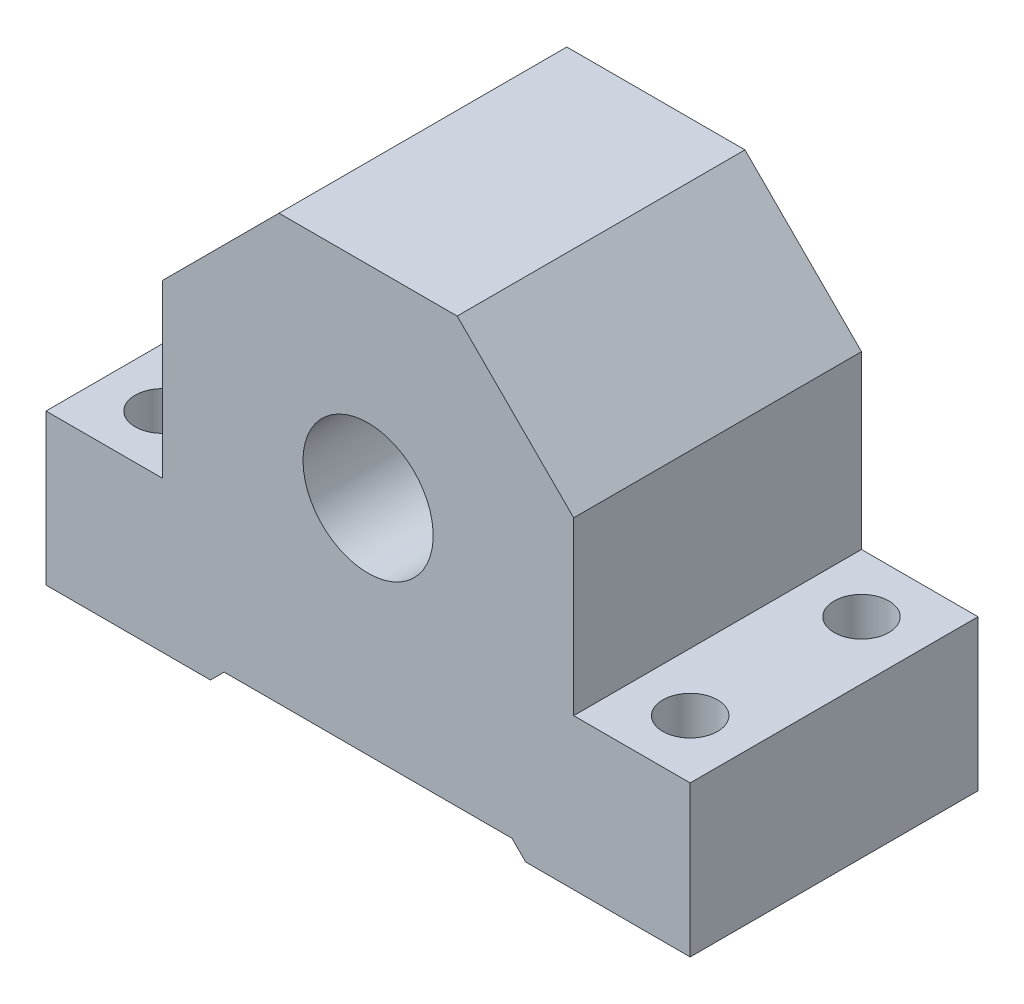
ISO-10303-21;
HEADER;
FILE_DESCRIPTION(('STEP AP214'),'2;1');
FILE_NAME('part.step','',(''),(''),'','','');
FILE_SCHEMA(('AUTOMOTIVE_DESIGN { 1 0 10303 214 1 1 1 1 }'));
ENDSEC;
DATA;
#1=APPLICATION_CONTEXT('core data for automotive mechanical design processes');
#2=APPLICATION_PROTOCOL_DEFINITION('international standard','automotive_design',2000,#1);
#3=PRODUCT_CONTEXT('',#1,'mechanical');
#4=PRODUCT('Part','Part','',(#3));
#5=PRODUCT_RELATED_PRODUCT_CATEGORY('part','',(#4));
#6=PRODUCT_DEFINITION_FORMATION('','',#4);
#7=PRODUCT_DEFINITION_CONTEXT('part definition',#1,'design');
#8=PRODUCT_DEFINITION('design','',#6,#7);
#9=PRODUCT_DEFINITION_SHAPE('','',#8);
#10=(LENGTH_UNIT() NAMED_UNIT(*) SI_UNIT(.MILLI.,.METRE.));
#11=(NAMED_UNIT(*) PLANE_ANGLE_UNIT() SI_UNIT($,.RADIAN.));
#12=(NAMED_UNIT(*) SI_UNIT($,.STERADIAN.) SOLID_ANGLE_UNIT());
#13=UNCERTAINTY_MEASURE_WITH_UNIT(LENGTH_MEASURE(1.E-05),#10,'distance_accuracy_value','');
#14=(GEOMETRIC_REPRESENTATION_CONTEXT(3) GLOBAL_UNCERTAINTY_ASSIGNED_CONTEXT((#13)) GLOBAL_UNIT_ASSIGNED_CONTEXT((#10,
#11,#12)) REPRESENTATION_CONTEXT('',''));
#15=CARTESIAN_POINT('',(0.,0.,0.));
#16=DIRECTION('',(0.,0.,1.));
#17=DIRECTION('',(1.,0.,0.));
#18=AXIS2_PLACEMENT_3D('',#15,#16,#17);
#19=CARTESIAN_POINT('',(-47.0000000000001,-11.,42.));
#20=DIRECTION('',(1.,0.,0.));
#21=DIRECTION('',(0.,1.,0.));
#22=AXIS2_PLACEMENT_3D('',#19,#20,#21);
#23=PLANE('',#22);
#24=DIRECTION('',(0.,-1.,0.));
#25=VECTOR('',#24,1.);
#26=CARTESIAN_POINT('',(-47.0000000000001,-11.,0.));
#27=LINE('',#26,#25);
#28=CARTESIAN_POINT('',(-47.0000000000001,11.,0.));
#29=VERTEX_POINT('',#28);
#30=CARTESIAN_POINT('',(-47.0000000000001,-11.,0.));
#31=VERTEX_POINT('',#30);
#32=EDGE_CURVE('E165',#29,#31,#27,.T.);
#33=ORIENTED_EDGE('',*,*,#32,.T.);
#34=DIRECTION('',(0.,0.,-1.));
#35=VECTOR('',#34,1.);
#36=CARTESIAN_POINT('',(-47.0000000000001,-11.,42.));
#37=LINE('',#36,#35);
#38=CARTESIAN_POINT('',(-47.0000000000001,-11.,42.));
#39=VERTEX_POINT('',#38);
#40=EDGE_CURVE('E11',#39,#31,#37,.T.);
#41=ORIENTED_EDGE('',*,*,#40,.F.);
#42=DIRECTION('',(0.,-1.,0.));
#43=VECTOR('',#42,1.);
#44=CARTESIAN_POINT('',(-47.0000000000001,-11.,42.));
#45=LINE('',#44,#43);
#46=CARTESIAN_POINT('',(-47.0000000000001,11.,42.));
#47=VERTEX_POINT('',#46);
#48=EDGE_CURVE('E192',#47,#39,#45,.T.);
#49=ORIENTED_EDGE('',*,*,#48,.F.);
#50=DIRECTION('',(0.,0.,-1.));
#51=VECTOR('',#50,1.);
#52=CARTESIAN_POINT('',(-47.0000000000001,11.,42.));
#53=LINE('',#52,#51);
#54=EDGE_CURVE('E161',#47,#29,#53,.T.);
#55=ORIENTED_EDGE('',*,*,#54,.T.);
#56=EDGE_LOOP('',(#33,#41,#49,#55));
#57=FACE_BOUND('',#56,.T.);
#58=ADVANCED_FACE('F33',(#57),#23,.F.);
#59=CARTESIAN_POINT('',(-47.0000000000001,-11.,42.));
#60=DIRECTION('',(0.,1.,0.));
#61=DIRECTION('',(0.,0.,1.));
#62=AXIS2_PLACEMENT_3D('',#59,#60,#61);
#63=PLANE('',#62);
#64=CARTESIAN_POINT('',(-38.5000000000001,-11.,33.5));
#65=DIRECTION('',(0.,1.,0.));
#66=DIRECTION('',(0.,0.,1.));
#67=AXIS2_PLACEMENT_3D('',#64,#65,#66);
#68=CIRCLE('',#67,4.);
#69=CARTESIAN_POINT('',(-38.5000000000001,-11.,37.5));
#70=VERTEX_POINT('',#69);
#71=EDGE_CURVE('E441',#70,#70,#68,.T.);
#72=ORIENTED_EDGE('',*,*,#71,.T.);
#73=EDGE_LOOP('',(#72));
#74=FACE_BOUND('',#73,.T.);
#75=CARTESIAN_POINT('',(-38.5000000000001,-11.,8.5));
#76=DIRECTION('',(0.,1.,0.));
#77=DIRECTION('',(0.,0.,1.));
#78=AXIS2_PLACEMENT_3D('',#75,#76,#77);
#79=CIRCLE('',#78,4.);
#80=CARTESIAN_POINT('',(-38.5000000000001,-11.,12.5));
#81=VERTEX_POINT('',#80);
#82=EDGE_CURVE('E434',#81,#81,#79,.T.);
#83=ORIENTED_EDGE('',*,*,#82,.T.);
#84=EDGE_LOOP('',(#83));
#85=FACE_BOUND('',#84,.T.);
#86=DIRECTION('',(1.,0.,0.));
#87=VECTOR('',#86,1.);
#88=CARTESIAN_POINT('',(-47.0000000000001,-11.,0.));
#89=LINE('',#88,#87);
#90=CARTESIAN_POINT('',(-23.0000000000001,-11.,0.));
#91=VERTEX_POINT('',#90);
#92=EDGE_CURVE('E168',#31,#91,#89,.T.);
#93=ORIENTED_EDGE('',*,*,#92,.T.);
#94=DIRECTION('',(0.,0.,-1.));
#95=VECTOR('',#94,1.);
#96=CARTESIAN_POINT('',(-23.0000000000001,-11.,42.));
#97=LINE('',#96,#95);
#98=CARTESIAN_POINT('',(-23.0000000000001,-11.,42.));
#99=VERTEX_POINT('',#98);
#100=EDGE_CURVE('E41',#99,#91,#97,.T.);
#101=ORIENTED_EDGE('',*,*,#100,.F.);
#102=DIRECTION('',(1.,0.,0.));
#103=VECTOR('',#102,1.);
#104=CARTESIAN_POINT('',(-47.0000000000001,-11.,42.));
#105=LINE('',#104,#103);
#106=EDGE_CURVE('E110',#39,#99,#105,.T.);
#107=ORIENTED_EDGE('',*,*,#106,.F.);
#108=ORIENTED_EDGE('',*,*,#40,.T.);
#109=EDGE_LOOP('',(#93,#101,#107,#108));
#110=FACE_BOUND('',#109,.T.);
#111=ADVANCED_FACE('F284',(#74,#85,#110),#63,.F.);
#112=CARTESIAN_POINT('',(-23.0000000000001,-11.,42.));
#113=DIRECTION('',(-0.707106781186549,0.707106781186546,0.));
#114=DIRECTION('',(-0.707106781186546,-0.707106781186549,0.));
#115=AXIS2_PLACEMENT_3D('',#112,#113,#114);
#116=PLANE('',#115);
#117=DIRECTION('',(0.707106781186546,0.707106781186549,0.));
#118=VECTOR('',#117,1.);
#119=CARTESIAN_POINT('',(-23.0000000000001,-11.,0.));
#120=LINE('',#119,#118);
#121=CARTESIAN_POINT('',(-21.0000000000001,-9.00000000000002,0.));
#122=VERTEX_POINT('',#121);
#123=EDGE_CURVE('E171',#91,#122,#120,.T.);
#124=ORIENTED_EDGE('',*,*,#123,.T.);
#125=DIRECTION('',(0.,0.,-1.));
#126=VECTOR('',#125,1.);
#127=CARTESIAN_POINT('',(-21.0000000000001,-9.00000000000002,42.));
#128=LINE('',#127,#126);
#129=CARTESIAN_POINT('',(-21.0000000000001,-9.00000000000002,42.));
#130=VERTEX_POINT('',#129);
#131=EDGE_CURVE('E217',#130,#122,#128,.T.);
#132=ORIENTED_EDGE('',*,*,#131,.F.);
#133=DIRECTION('',(0.707106781186546,0.707106781186549,0.));
#134=VECTOR('',#133,1.);
#135=CARTESIAN_POINT('',(-23.0000000000001,-11.,42.));
#136=LINE('',#135,#134);
#137=EDGE_CURVE('E225',#99,#130,#136,.T.);
#138=ORIENTED_EDGE('',*,*,#137,.F.);
#139=ORIENTED_EDGE('',*,*,#100,.T.);
#140=EDGE_LOOP('',(#124,#132,#138,#139));
#141=FACE_BOUND('',#140,.T.);
#142=ADVANCED_FACE('F223',(#141),#116,.F.);
#143=CARTESIAN_POINT('',(-21.0000000000001,-9.00000000000002,42.));
#144=DIRECTION('',(0.,1.,0.));
#145=DIRECTION('',(0.,0.,1.));
#146=AXIS2_PLACEMENT_3D('',#143,#144,#145);
#147=PLANE('',#146);
#148=DIRECTION('',(1.,0.,0.));
#149=VECTOR('',#148,1.);
#150=CARTESIAN_POINT('',(-21.0000000000001,-9.00000000000002,0.));
#151=LINE('',#150,#149);
#152=CARTESIAN_POINT('',(20.9999999999999,-9.00000000000002,0.));
#153=VERTEX_POINT('',#152);
#154=EDGE_CURVE('E173',#122,#153,#151,.T.);
#155=ORIENTED_EDGE('',*,*,#154,.T.);
#156=DIRECTION('',(0.,0.,-1.));
#157=VECTOR('',#156,1.);
#158=CARTESIAN_POINT('',(20.9999999999999,-9.00000000000002,42.));
#159=LINE('',#158,#157);
#160=CARTESIAN_POINT('',(20.9999999999999,-9.00000000000002,42.));
#161=VERTEX_POINT('',#160);
#162=EDGE_CURVE('E214',#161,#153,#159,.T.);
#163=ORIENTED_EDGE('',*,*,#162,.F.);
#164=DIRECTION('',(1.,0.,0.));
#165=VECTOR('',#164,1.);
#166=CARTESIAN_POINT('',(-21.0000000000001,-9.00000000000002,42.));
#167=LINE('',#166,#165);
#168=EDGE_CURVE('E243',#130,#161,#167,.T.);
#169=ORIENTED_EDGE('',*,*,#168,.F.);
#170=ORIENTED_EDGE('',*,*,#131,.T.);
#171=EDGE_LOOP('',(#155,#163,#169,#170));
#172=FACE_BOUND('',#171,.T.);
#173=ADVANCED_FACE('F234',(#172),#147,.F.);
#174=CARTESIAN_POINT('',(20.9999999999999,-9.00000000000002,42.));
#175=DIRECTION('',(0.707106781186545,0.70710678118655,0.));
#176=DIRECTION('',(-0.70710678118655,0.707106781186545,0.));
#177=AXIS2_PLACEMENT_3D('',#174,#175,#176);
#178=PLANE('',#177);
#179=DIRECTION('',(0.70710678118655,-0.707106781186545,0.));
#180=VECTOR('',#179,1.);
#181=CARTESIAN_POINT('',(20.9999999999999,-9.00000000000002,0.));
#182=LINE('',#181,#180);
#183=CARTESIAN_POINT('',(22.9999999999999,-11.,0.));
#184=VERTEX_POINT('',#183);
#185=EDGE_CURVE('E175',#153,#184,#182,.T.);
#186=ORIENTED_EDGE('',*,*,#185,.T.);
#187=DIRECTION('',(0.,0.,-1.));
#188=VECTOR('',#187,1.);
#189=CARTESIAN_POINT('',(22.9999999999999,-11.,42.));
#190=LINE('',#189,#188);
#191=CARTESIAN_POINT('',(22.9999999999999,-11.,42.));
#192=VERTEX_POINT('',#191);
#193=EDGE_CURVE('E211',#192,#184,#190,.T.);
#194=ORIENTED_EDGE('',*,*,#193,.F.);
#195=DIRECTION('',(0.70710678118655,-0.707106781186545,0.));
#196=VECTOR('',#195,1.);
#197=CARTESIAN_POINT('',(20.9999999999999,-9.00000000000002,42.));
#198=LINE('',#197,#196);
#199=EDGE_CURVE('E240',#161,#192,#198,.T.);
#200=ORIENTED_EDGE('',*,*,#199,.F.);
#201=ORIENTED_EDGE('',*,*,#162,.T.);
#202=EDGE_LOOP('',(#186,#194,#200,#201));
#203=FACE_BOUND('',#202,.T.);
#204=ADVANCED_FACE('F238',(#203),#178,.F.);
#205=CARTESIAN_POINT('',(22.9999999999999,-11.,42.));
#206=DIRECTION('',(0.,1.,0.));
#207=DIRECTION('',(-1.,0.,0.));
#208=AXIS2_PLACEMENT_3D('',#205,#206,#207);
#209=PLANE('',#208);
#210=CARTESIAN_POINT('',(38.4999999999999,-11.,8.5));
#211=DIRECTION('',(0.,1.,0.));
#212=DIRECTION('',(0.,0.,1.));
#213=AXIS2_PLACEMENT_3D('',#210,#211,#212);
#214=CIRCLE('',#213,4.00000000000001);
#215=CARTESIAN_POINT('',(38.4999999999999,-11.,12.5));
#216=VERTEX_POINT('',#215);
#217=EDGE_CURVE('E425',#216,#216,#214,.T.);
#218=ORIENTED_EDGE('',*,*,#217,.T.);
#219=EDGE_LOOP('',(#218));
#220=FACE_BOUND('',#219,.T.);
#221=CARTESIAN_POINT('',(38.4999999999999,-11.,33.5));
#222=DIRECTION('',(0.,1.,0.));
#223=DIRECTION('',(0.,0.,1.));
#224=AXIS2_PLACEMENT_3D('',#221,#222,#223);
#225=CIRCLE('',#224,4.00000000000001);
#226=CARTESIAN_POINT('',(38.4999999999999,-11.,37.5));
#227=VERTEX_POINT('',#226);
#228=EDGE_CURVE('E456',#227,#227,#225,.T.);
#229=ORIENTED_EDGE('',*,*,#228,.T.);
#230=EDGE_LOOP('',(#229));
#231=FACE_BOUND('',#230,.T.);
#232=DIRECTION('',(1.,0.,0.));
#233=VECTOR('',#232,1.);
#234=CARTESIAN_POINT('',(22.9999999999999,-11.,0.));
#235=LINE('',#234,#233);
#236=CARTESIAN_POINT('',(46.9999999999999,-11.,0.));
#237=VERTEX_POINT('',#236);
#238=EDGE_CURVE('E177',#184,#237,#235,.T.);
#239=ORIENTED_EDGE('',*,*,#238,.T.);
#240=DIRECTION('',(0.,0.,-1.));
#241=VECTOR('',#240,1.);
#242=CARTESIAN_POINT('',(46.9999999999999,-11.,42.));
#243=LINE('',#242,#241);
#244=CARTESIAN_POINT('',(46.9999999999999,-11.,42.));
#245=VERTEX_POINT('',#244);
#246=EDGE_CURVE('E208',#245,#237,#243,.T.);
#247=ORIENTED_EDGE('',*,*,#246,.F.);
#248=DIRECTION('',(1.,0.,0.));
#249=VECTOR('',#248,1.);
#250=CARTESIAN_POINT('',(22.9999999999999,-11.,42.));
#251=LINE('',#250,#249);
#252=EDGE_CURVE('E242',#192,#245,#251,.T.);
#253=ORIENTED_EDGE('',*,*,#252,.F.);
#254=ORIENTED_EDGE('',*,*,#193,.T.);
#255=EDGE_LOOP('',(#239,#247,#253,#254));
#256=FACE_BOUND('',#255,.T.);
#257=ADVANCED_FACE('F300',(#220,#231,#256),#209,.F.);
#258=CARTESIAN_POINT('',(46.9999999999999,-11.,42.));
#259=DIRECTION('',(-1.,0.,0.));
#260=DIRECTION('',(0.,-1.,0.));
#261=AXIS2_PLACEMENT_3D('',#258,#259,#260);
#262=PLANE('',#261);
#263=DIRECTION('',(0.,1.,0.));
#264=VECTOR('',#263,1.);
#265=CARTESIAN_POINT('',(46.9999999999999,-11.,0.));
#266=LINE('',#265,#264);
#267=CARTESIAN_POINT('',(46.9999999999999,11.,0.));
#268=VERTEX_POINT('',#267);
#269=EDGE_CURVE('E179',#237,#268,#266,.T.);
#270=ORIENTED_EDGE('',*,*,#269,.T.);
#271=DIRECTION('',(0.,0.,-1.));
#272=VECTOR('',#271,1.);
#273=CARTESIAN_POINT('',(46.9999999999999,11.,42.));
#274=LINE('',#273,#272);
#275=CARTESIAN_POINT('',(46.9999999999999,11.,42.));
#276=VERTEX_POINT('',#275);
#277=EDGE_CURVE('E205',#276,#268,#274,.T.);
#278=ORIENTED_EDGE('',*,*,#277,.F.);
#279=DIRECTION('',(0.,1.,0.));
#280=VECTOR('',#279,1.);
#281=CARTESIAN_POINT('',(46.9999999999999,-11.,42.));
#282=LINE('',#281,#280);
#283=EDGE_CURVE('E245',#245,#276,#282,.T.);
#284=ORIENTED_EDGE('',*,*,#283,.F.);
#285=ORIENTED_EDGE('',*,*,#246,.T.);
#286=EDGE_LOOP('',(#270,#278,#284,#285));
#287=FACE_BOUND('',#286,.T.);
#288=ADVANCED_FACE('F303',(#287),#262,.F.);
#289=CARTESIAN_POINT('',(29.9999999999999,11.,42.));
#290=DIRECTION('',(0.,-1.,0.));
#291=DIRECTION('',(0.,0.,-1.));
#292=AXIS2_PLACEMENT_3D('',#289,#290,#291);
#293=PLANE('',#292);
#294=CARTESIAN_POINT('',(38.4999999999999,11.,8.5));
#295=DIRECTION('',(0.,1.,0.));
#296=DIRECTION('',(0.,0.,1.));
#297=AXIS2_PLACEMENT_3D('',#294,#295,#296);
#298=CIRCLE('',#297,4.00000000000001);
#299=CARTESIAN_POINT('',(38.4999999999999,11.,12.5));
#300=VERTEX_POINT('',#299);
#301=EDGE_CURVE('E428',#300,#300,#298,.T.);
#302=ORIENTED_EDGE('',*,*,#301,.F.);
#303=EDGE_LOOP('',(#302));
#304=FACE_BOUND('',#303,.T.);
#305=CARTESIAN_POINT('',(38.4999999999999,11.,33.5));
#306=DIRECTION('',(0.,1.,0.));
#307=DIRECTION('',(0.,0.,1.));
#308=AXIS2_PLACEMENT_3D('',#305,#306,#307);
#309=CIRCLE('',#308,4.00000000000001);
#310=CARTESIAN_POINT('',(38.4999999999999,11.,37.5));
#311=VERTEX_POINT('',#310);
#312=EDGE_CURVE('E430',#311,#311,#309,.T.);
#313=ORIENTED_EDGE('',*,*,#312,.F.);
#314=EDGE_LOOP('',(#313));
#315=FACE_BOUND('',#314,.T.);
#316=DIRECTION('',(-1.,0.,0.));
#317=VECTOR('',#316,1.);
#318=CARTESIAN_POINT('',(29.9999999999999,11.,0.));
#319=LINE('',#318,#317);
#320=CARTESIAN_POINT('',(29.9999999999999,11.,0.));
#321=VERTEX_POINT('',#320);
#322=EDGE_CURVE('E181',#268,#321,#319,.T.);
#323=ORIENTED_EDGE('',*,*,#322,.T.);
#324=DIRECTION('',(0.,0.,-1.));
#325=VECTOR('',#324,1.);
#326=CARTESIAN_POINT('',(29.9999999999999,11.,42.));
#327=LINE('',#326,#325);
#328=CARTESIAN_POINT('',(29.9999999999999,11.,42.));
#329=VERTEX_POINT('',#328);
#330=EDGE_CURVE('E202',#329,#321,#327,.T.);
#331=ORIENTED_EDGE('',*,*,#330,.F.);
#332=DIRECTION('',(-1.,0.,0.));
#333=VECTOR('',#332,1.);
#334=CARTESIAN_POINT('',(29.9999999999999,11.,42.));
#335=LINE('',#334,#333);
#336=EDGE_CURVE('E251',#276,#329,#335,.T.);
#337=ORIENTED_EDGE('',*,*,#336,.F.);
#338=ORIENTED_EDGE('',*,*,#277,.T.);
#339=EDGE_LOOP('',(#323,#331,#337,#338));
#340=FACE_BOUND('',#339,.T.);
#341=ADVANCED_FACE('F307',(#304,#315,#340),#293,.F.);
#342=CARTESIAN_POINT('',(29.9999999999999,35.9999999999999,42.));
#343=DIRECTION('',(-1.,0.,0.));
#344=DIRECTION('',(0.,0.,1.));
#345=AXIS2_PLACEMENT_3D('',#342,#343,#344);
#346=PLANE('',#345);
#347=DIRECTION('',(0.,1.,0.));
#348=VECTOR('',#347,1.);
#349=CARTESIAN_POINT('',(29.9999999999999,35.9999999999999,0.));
#350=LINE('',#349,#348);
#351=CARTESIAN_POINT('',(29.9999999999999,35.9999999999999,0.));
#352=VERTEX_POINT('',#351);
#353=EDGE_CURVE('E183',#321,#352,#350,.T.);
#354=ORIENTED_EDGE('',*,*,#353,.T.);
#355=DIRECTION('',(0.,0.,-1.));
#356=VECTOR('',#355,1.);
#357=CARTESIAN_POINT('',(29.9999999999999,35.9999999999999,42.));
#358=LINE('',#357,#356);
#359=CARTESIAN_POINT('',(29.9999999999999,35.9999999999999,42.));
#360=VERTEX_POINT('',#359);
#361=EDGE_CURVE('E199',#360,#352,#358,.T.);
#362=ORIENTED_EDGE('',*,*,#361,.F.);
#363=DIRECTION('',(0.,1.,0.));
#364=VECTOR('',#363,1.);
#365=CARTESIAN_POINT('',(29.9999999999999,35.9999999999999,42.));
#366=LINE('',#365,#364);
#367=EDGE_CURVE('E253',#329,#360,#366,.T.);
#368=ORIENTED_EDGE('',*,*,#367,.F.);
#369=ORIENTED_EDGE('',*,*,#330,.T.);
#370=EDGE_LOOP('',(#354,#362,#368,#369));
#371=FACE_BOUND('',#370,.T.);
#372=ADVANCED_FACE('F311',(#371),#346,.F.);
#373=CARTESIAN_POINT('',(12.9999999999999,53.,42.));
#374=DIRECTION('',(-0.707106781186549,-0.707106781186546,0.));
#375=DIRECTION('',(0.707106781186546,-0.707106781186549,0.));
#376=AXIS2_PLACEMENT_3D('',#373,#374,#375);
#377=PLANE('',#376);
#378=DIRECTION('',(-0.707106781186547,0.707106781186549,0.));
#379=VECTOR('',#378,1.);
#380=CARTESIAN_POINT('',(12.9999999999999,53.,0.));
#381=LINE('',#380,#379);
#382=CARTESIAN_POINT('',(12.9999999999999,53.,0.));
#383=VERTEX_POINT('',#382);
#384=EDGE_CURVE('E185',#352,#383,#381,.T.);
#385=ORIENTED_EDGE('',*,*,#384,.T.);
#386=DIRECTION('',(0.,0.,-1.));
#387=VECTOR('',#386,1.);
#388=CARTESIAN_POINT('',(12.9999999999999,53.,42.));
#389=LINE('',#388,#387);
#390=CARTESIAN_POINT('',(12.9999999999999,53.,42.));
#391=VERTEX_POINT('',#390);
#392=EDGE_CURVE('E196',#391,#383,#389,.T.);
#393=ORIENTED_EDGE('',*,*,#392,.F.);
#394=DIRECTION('',(-0.707106781186547,0.707106781186549,0.));
#395=VECTOR('',#394,1.);
#396=CARTESIAN_POINT('',(12.9999999999999,53.,42.));
#397=LINE('',#396,#395);
#398=EDGE_CURVE('E255',#360,#391,#397,.T.);
#399=ORIENTED_EDGE('',*,*,#398,.F.);
#400=ORIENTED_EDGE('',*,*,#361,.T.);
#401=EDGE_LOOP('',(#385,#393,#399,#400));
#402=FACE_BOUND('',#401,.T.);
#403=ADVANCED_FACE('F261',(#402),#377,.F.);
#404=CARTESIAN_POINT('',(-13.0000000000001,53.,42.));
#405=DIRECTION('',(0.,-1.,0.));
#406=DIRECTION('',(0.,0.,-1.));
#407=AXIS2_PLACEMENT_3D('',#404,#405,#406);
#408=PLANE('',#407);
#409=DIRECTION('',(-1.,0.,0.));
#410=VECTOR('',#409,1.);
#411=CARTESIAN_POINT('',(-13.0000000000001,53.,0.));
#412=LINE('',#411,#410);
#413=CARTESIAN_POINT('',(-13.0000000000001,53.,0.));
#414=VERTEX_POINT('',#413);
#415=EDGE_CURVE('E187',#383,#414,#412,.T.);
#416=ORIENTED_EDGE('',*,*,#415,.T.);
#417=DIRECTION('',(0.,0.,-1.));
#418=VECTOR('',#417,1.);
#419=CARTESIAN_POINT('',(-13.0000000000001,53.,42.));
#420=LINE('',#419,#418);
#421=CARTESIAN_POINT('',(-13.0000000000001,53.,42.));
#422=VERTEX_POINT('',#421);
#423=EDGE_CURVE('E156',#422,#414,#420,.T.);
#424=ORIENTED_EDGE('',*,*,#423,.F.);
#425=DIRECTION('',(-1.,0.,0.));
#426=VECTOR('',#425,1.);
#427=CARTESIAN_POINT('',(-13.0000000000001,53.,42.));
#428=LINE('',#427,#426);
#429=EDGE_CURVE('E147',#391,#422,#428,.T.);
#430=ORIENTED_EDGE('',*,*,#429,.F.);
#431=ORIENTED_EDGE('',*,*,#392,.T.);
#432=EDGE_LOOP('',(#416,#424,#430,#431));
#433=FACE_BOUND('',#432,.T.);
#434=ADVANCED_FACE('F265',(#433),#408,.F.);
#435=CARTESIAN_POINT('',(-30.0000000000001,35.9999999999999,42.));
#436=DIRECTION('',(0.707106781186549,-0.707106781186546,0.));
#437=DIRECTION('',(0.707106781186546,0.707106781186549,0.));
#438=AXIS2_PLACEMENT_3D('',#435,#436,#437);
#439=PLANE('',#438);
#440=DIRECTION('',(-0.707106781186546,-0.707106781186549,0.));
#441=VECTOR('',#440,1.);
#442=CARTESIAN_POINT('',(-30.0000000000001,35.9999999999999,0.));
#443=LINE('',#442,#441);
#444=CARTESIAN_POINT('',(-30.0000000000001,35.9999999999999,0.));
#445=VERTEX_POINT('',#444);
#446=EDGE_CURVE('E155',#414,#445,#443,.T.);
#447=ORIENTED_EDGE('',*,*,#446,.T.);
#448=DIRECTION('',(0.,0.,-1.));
#449=VECTOR('',#448,1.);
#450=CARTESIAN_POINT('',(-30.0000000000001,35.9999999999999,42.));
#451=LINE('',#450,#449);
#452=CARTESIAN_POINT('',(-30.0000000000001,35.9999999999999,42.));
#453=VERTEX_POINT('',#452);
#454=EDGE_CURVE('E152',#453,#445,#451,.T.);
#455=ORIENTED_EDGE('',*,*,#454,.F.);
#456=DIRECTION('',(-0.707106781186546,-0.707106781186549,0.));
#457=VECTOR('',#456,1.);
#458=CARTESIAN_POINT('',(-30.0000000000001,35.9999999999999,42.));
#459=LINE('',#458,#457);
#460=EDGE_CURVE('E141',#422,#453,#459,.T.);
#461=ORIENTED_EDGE('',*,*,#460,.F.);
#462=ORIENTED_EDGE('',*,*,#423,.T.);
#463=EDGE_LOOP('',(#447,#455,#461,#462));
#464=FACE_BOUND('',#463,.T.);
#465=ADVANCED_FACE('F153',(#464),#439,.F.);
#466=CARTESIAN_POINT('',(-30.0000000000001,11.,42.));
#467=DIRECTION('',(1.,0.,0.));
#468=DIRECTION('',(0.,1.,0.));
#469=AXIS2_PLACEMENT_3D('',#466,#467,#468);
#470=PLANE('',#469);
#471=DIRECTION('',(0.,-1.,0.));
#472=VECTOR('',#471,1.);
#473=CARTESIAN_POINT('',(-30.0000000000001,11.,0.));
#474=LINE('',#473,#472);
#475=CARTESIAN_POINT('',(-30.0000000000001,11.,0.));
#476=VERTEX_POINT('',#475);
#477=EDGE_CURVE('E96',#445,#476,#474,.T.);
#478=ORIENTED_EDGE('',*,*,#477,.T.);
#479=DIRECTION('',(0.,0.,-1.));
#480=VECTOR('',#479,1.);
#481=CARTESIAN_POINT('',(-30.0000000000001,11.,42.));
#482=LINE('',#481,#480);
#483=CARTESIAN_POINT('',(-30.0000000000001,11.,42.));
#484=VERTEX_POINT('',#483);
#485=EDGE_CURVE('E157',#484,#476,#482,.T.);
#486=ORIENTED_EDGE('',*,*,#485,.F.);
#487=DIRECTION('',(0.,-1.,0.));
#488=VECTOR('',#487,1.);
#489=CARTESIAN_POINT('',(-30.0000000000001,11.,42.));
#490=LINE('',#489,#488);
#491=EDGE_CURVE('E145',#453,#484,#490,.T.);
#492=ORIENTED_EDGE('',*,*,#491,.F.);
#493=ORIENTED_EDGE('',*,*,#454,.T.);
#494=EDGE_LOOP('',(#478,#486,#492,#493));
#495=FACE_BOUND('',#494,.T.);
#496=ADVANCED_FACE('F159',(#495),#470,.F.);
#497=CARTESIAN_POINT('',(-47.0000000000001,11.,42.));
#498=DIRECTION('',(0.,-1.,0.));
#499=DIRECTION('',(0.,0.,-1.));
#500=AXIS2_PLACEMENT_3D('',#497,#498,#499);
#501=PLANE('',#500);
#502=CARTESIAN_POINT('',(-38.5000000000001,11.,33.5));
#503=DIRECTION('',(0.,1.,0.));
#504=DIRECTION('',(0.,0.,1.));
#505=AXIS2_PLACEMENT_3D('',#502,#503,#504);
#506=CIRCLE('',#505,4.);
#507=CARTESIAN_POINT('',(-38.5000000000001,11.,37.5));
#508=VERTEX_POINT('',#507);
#509=EDGE_CURVE('E452',#508,#508,#506,.T.);
#510=ORIENTED_EDGE('',*,*,#509,.F.);
#511=EDGE_LOOP('',(#510));
#512=FACE_BOUND('',#511,.T.);
#513=CARTESIAN_POINT('',(-38.5000000000001,11.,8.5));
#514=DIRECTION('',(0.,1.,0.));
#515=DIRECTION('',(0.,0.,1.));
#516=AXIS2_PLACEMENT_3D('',#513,#514,#515);
#517=CIRCLE('',#516,4.);
#518=CARTESIAN_POINT('',(-38.5000000000001,11.,12.5));
#519=VERTEX_POINT('',#518);
#520=EDGE_CURVE('E438',#519,#519,#517,.T.);
#521=ORIENTED_EDGE('',*,*,#520,.F.);
#522=EDGE_LOOP('',(#521));
#523=FACE_BOUND('',#522,.T.);
#524=DIRECTION('',(-1.,0.,0.));
#525=VECTOR('',#524,1.);
#526=CARTESIAN_POINT('',(-47.0000000000001,11.,0.));
#527=LINE('',#526,#525);
#528=EDGE_CURVE('E102',#476,#29,#527,.T.);
#529=ORIENTED_EDGE('',*,*,#528,.T.);
#530=ORIENTED_EDGE('',*,*,#54,.F.);
#531=DIRECTION('',(-1.,0.,0.));
#532=VECTOR('',#531,1.);
#533=CARTESIAN_POINT('',(-47.0000000000001,11.,42.));
#534=LINE('',#533,#532);
#535=EDGE_CURVE('E49',#484,#47,#534,.T.);
#536=ORIENTED_EDGE('',*,*,#535,.F.);
#537=ORIENTED_EDGE('',*,*,#485,.T.);
#538=EDGE_LOOP('',(#529,#530,#536,#537));
#539=FACE_BOUND('',#538,.T.);
#540=ADVANCED_FACE('F269',(#512,#523,#539),#501,.F.);
#541=CARTESIAN_POINT('',(0.,0.,42.));
#542=DIRECTION('',(0.,0.,-1.));
#543=DIRECTION('',(-1.,0.,0.));
#544=AXIS2_PLACEMENT_3D('',#541,#542,#543);
#545=PLANE('',#544);
#546=CARTESIAN_POINT('',(0.,23.5,42.));
#547=DIRECTION('',(0.,0.,-1.));
#548=DIRECTION('',(-1.,0.,0.));
#549=AXIS2_PLACEMENT_3D('',#546,#547,#548);
#550=CIRCLE('',#549,9.5);
#551=CARTESIAN_POINT('',(-9.5,23.5,42.));
#552=VERTEX_POINT('',#551);
#553=EDGE_CURVE('E169',#552,#552,#550,.T.);
#554=ORIENTED_EDGE('',*,*,#553,.T.);
#555=EDGE_LOOP('',(#554));
#556=FACE_BOUND('',#555,.T.);
#557=ORIENTED_EDGE('',*,*,#48,.T.);
#558=ORIENTED_EDGE('',*,*,#106,.T.);
#559=ORIENTED_EDGE('',*,*,#137,.T.);
#560=ORIENTED_EDGE('',*,*,#168,.T.);
#561=ORIENTED_EDGE('',*,*,#199,.T.);
#562=ORIENTED_EDGE('',*,*,#252,.T.);
#563=ORIENTED_EDGE('',*,*,#283,.T.);
#564=ORIENTED_EDGE('',*,*,#336,.T.);
#565=ORIENTED_EDGE('',*,*,#367,.T.);
#566=ORIENTED_EDGE('',*,*,#398,.T.);
#567=ORIENTED_EDGE('',*,*,#429,.T.);
#568=ORIENTED_EDGE('',*,*,#460,.T.);
#569=ORIENTED_EDGE('',*,*,#491,.T.);
#570=ORIENTED_EDGE('',*,*,#535,.T.);
#571=EDGE_LOOP('',(#557,#558,#559,#560,#561,#562,#563,#564,#565,#566,#567,#568,#569,#570));
#572=FACE_BOUND('',#571,.T.);
#573=ADVANCED_FACE('F143',(#556,#572),#545,.F.);
#574=CARTESIAN_POINT('',(0.,0.,0.));
#575=DIRECTION('',(0.,0.,-1.));
#576=DIRECTION('',(-1.,0.,0.));
#577=AXIS2_PLACEMENT_3D('',#574,#575,#576);
#578=PLANE('',#577);
#579=CARTESIAN_POINT('',(0.,23.5,0.));
#580=DIRECTION('',(0.,0.,-1.));
#581=DIRECTION('',(-1.,0.,0.));
#582=AXIS2_PLACEMENT_3D('',#579,#580,#581);
#583=CIRCLE('',#582,9.5);
#584=CARTESIAN_POINT('',(-9.5,23.5,0.));
#585=VERTEX_POINT('',#584);
#586=EDGE_CURVE('E437',#585,#585,#583,.T.);
#587=ORIENTED_EDGE('',*,*,#586,.F.);
#588=EDGE_LOOP('',(#587));
#589=FACE_BOUND('',#588,.T.);
#590=ORIENTED_EDGE('',*,*,#32,.F.);
#591=ORIENTED_EDGE('',*,*,#528,.F.);
#592=ORIENTED_EDGE('',*,*,#477,.F.);
#593=ORIENTED_EDGE('',*,*,#446,.F.);
#594=ORIENTED_EDGE('',*,*,#415,.F.);
#595=ORIENTED_EDGE('',*,*,#384,.F.);
#596=ORIENTED_EDGE('',*,*,#353,.F.);
#597=ORIENTED_EDGE('',*,*,#322,.F.);
#598=ORIENTED_EDGE('',*,*,#269,.F.);
#599=ORIENTED_EDGE('',*,*,#238,.F.);
#600=ORIENTED_EDGE('',*,*,#185,.F.);
#601=ORIENTED_EDGE('',*,*,#154,.F.);
#602=ORIENTED_EDGE('',*,*,#123,.F.);
#603=ORIENTED_EDGE('',*,*,#92,.F.);
#604=EDGE_LOOP('',(#590,#591,#592,#593,#594,#595,#596,#597,#598,#599,#600,#601,#602,#603));
#605=FACE_BOUND('',#604,.T.);
#606=ADVANCED_FACE('F229',(#589,#605),#578,.T.);
#607=CARTESIAN_POINT('',(0.,23.5,42.));
#608=DIRECTION('',(0.,0.,-1.));
#609=DIRECTION('',(-1.,0.,0.));
#610=AXIS2_PLACEMENT_3D('',#607,#608,#609);
#611=CYLINDRICAL_SURFACE('',#610,9.5);
#612=ORIENTED_EDGE('',*,*,#553,.F.);
#613=EDGE_LOOP('',(#612));
#614=FACE_BOUND('',#613,.T.);
#615=ORIENTED_EDGE('',*,*,#586,.T.);
#616=EDGE_LOOP('',(#615));
#617=FACE_BOUND('',#616,.T.);
#618=ADVANCED_FACE('F345',(#614,#617),#611,.F.);
#619=CARTESIAN_POINT('',(-38.5000000000001,-11.,8.5));
#620=DIRECTION('',(0.,1.,0.));
#621=DIRECTION('',(0.,0.,1.));
#622=AXIS2_PLACEMENT_3D('',#619,#620,#621);
#623=CYLINDRICAL_SURFACE('',#622,4.);
#624=ORIENTED_EDGE('',*,*,#82,.F.);
#625=EDGE_LOOP('',(#624));
#626=FACE_BOUND('',#625,.T.);
#627=ORIENTED_EDGE('',*,*,#520,.T.);
#628=EDGE_LOOP('',(#627));
#629=FACE_BOUND('',#628,.T.);
#630=ADVANCED_FACE('F353',(#626,#629),#623,.F.);
#631=CARTESIAN_POINT('',(-38.5000000000001,-11.,33.5));
#632=DIRECTION('',(0.,1.,0.));
#633=DIRECTION('',(0.,0.,1.));
#634=AXIS2_PLACEMENT_3D('',#631,#632,#633);
#635=CYLINDRICAL_SURFACE('',#634,4.);
#636=ORIENTED_EDGE('',*,*,#71,.F.);
#637=EDGE_LOOP('',(#636));
#638=FACE_BOUND('',#637,.T.);
#639=ORIENTED_EDGE('',*,*,#509,.T.);
#640=EDGE_LOOP('',(#639));
#641=FACE_BOUND('',#640,.T.);
#642=ADVANCED_FACE('F388',(#638,#641),#635,.F.);
#643=CARTESIAN_POINT('',(38.4999999999999,-11.,33.5));
#644=DIRECTION('',(0.,1.,0.));
#645=DIRECTION('',(0.,0.,1.));
#646=AXIS2_PLACEMENT_3D('',#643,#644,#645);
#647=CYLINDRICAL_SURFACE('',#646,4.00000000000001);
#648=ORIENTED_EDGE('',*,*,#228,.F.);
#649=EDGE_LOOP('',(#648));
#650=FACE_BOUND('',#649,.T.);
#651=ORIENTED_EDGE('',*,*,#312,.T.);
#652=EDGE_LOOP('',(#651));
#653=FACE_BOUND('',#652,.T.);
#654=ADVANCED_FACE('F398',(#650,#653),#647,.F.);
#655=CARTESIAN_POINT('',(38.4999999999999,-11.,8.5));
#656=DIRECTION('',(0.,1.,0.));
#657=DIRECTION('',(0.,0.,1.));
#658=AXIS2_PLACEMENT_3D('',#655,#656,#657);
#659=CYLINDRICAL_SURFACE('',#658,4.00000000000001);
#660=ORIENTED_EDGE('',*,*,#217,.F.);
#661=EDGE_LOOP('',(#660));
#662=FACE_BOUND('',#661,.T.);
#663=ORIENTED_EDGE('',*,*,#301,.T.);
#664=EDGE_LOOP('',(#663));
#665=FACE_BOUND('',#664,.T.);
#666=ADVANCED_FACE('F408',(#662,#665),#659,.F.);
#667=CLOSED_SHELL('',(#58,#111,#142,#173,#204,#257,#288,#341,#372,#403,#434,#465,#496,#540,#573,
#606,#618,#630,#642,#654,#666));
#668=MANIFOLD_SOLID_BREP('B2',#667);
#669=ADVANCED_BREP_SHAPE_REPRESENTATION('',(#18,#668),#14);
#670=SHAPE_DEFINITION_REPRESENTATION(#9,#669);
ENDSEC;
END-ISO-10303-21;
